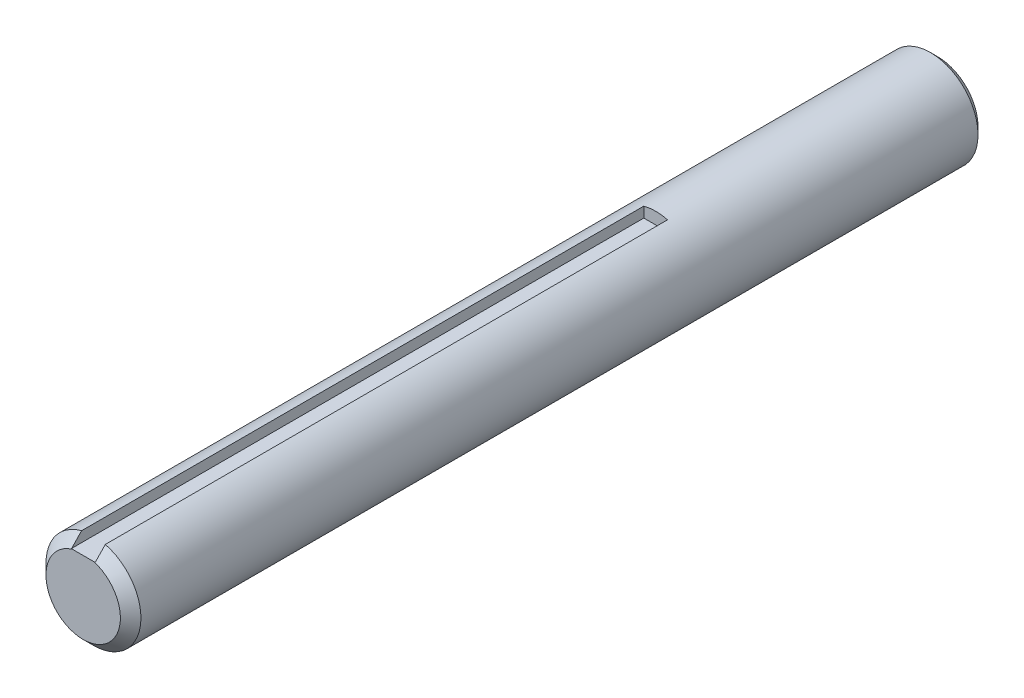
ISO-10303-21;
HEADER;
FILE_DESCRIPTION(('STEP AP214'),'2;1');
FILE_NAME('part.step','',(''),(''),'','','');
FILE_SCHEMA(('AUTOMOTIVE_DESIGN { 1 0 10303 214 1 1 1 1 }'));
ENDSEC;
DATA;
#1=APPLICATION_CONTEXT('core data for automotive mechanical design processes');
#2=APPLICATION_PROTOCOL_DEFINITION('international standard','automotive_design',2000,#1);
#3=PRODUCT_CONTEXT('',#1,'mechanical');
#4=PRODUCT('Part','Part','',(#3));
#5=PRODUCT_RELATED_PRODUCT_CATEGORY('part','',(#4));
#6=PRODUCT_DEFINITION_FORMATION('','',#4);
#7=PRODUCT_DEFINITION_CONTEXT('part definition',#1,'design');
#8=PRODUCT_DEFINITION('design','',#6,#7);
#9=PRODUCT_DEFINITION_SHAPE('','',#8);
#10=(LENGTH_UNIT() NAMED_UNIT(*) SI_UNIT(.MILLI.,.METRE.));
#11=(NAMED_UNIT(*) PLANE_ANGLE_UNIT() SI_UNIT($,.RADIAN.));
#12=(NAMED_UNIT(*) SI_UNIT($,.STERADIAN.) SOLID_ANGLE_UNIT());
#13=UNCERTAINTY_MEASURE_WITH_UNIT(LENGTH_MEASURE(1.E-05),#10,'distance_accuracy_value','');
#14=(GEOMETRIC_REPRESENTATION_CONTEXT(3) GLOBAL_UNCERTAINTY_ASSIGNED_CONTEXT((#13)) GLOBAL_UNIT_ASSIGNED_CONTEXT((#10,
#11,#12)) REPRESENTATION_CONTEXT('',''));
#15=CARTESIAN_POINT('',(0.,0.,0.));
#16=DIRECTION('',(0.,0.,1.));
#17=DIRECTION('',(1.,0.,0.));
#18=AXIS2_PLACEMENT_3D('',#15,#16,#17);
#19=CARTESIAN_POINT('',(0.,0.,76.2));
#20=DIRECTION('',(0.,0.,-1.));
#21=DIRECTION('',(-1.,0.,0.));
#22=AXIS2_PLACEMENT_3D('',#19,#20,#21);
#23=CYLINDRICAL_SURFACE('',#22,6.35);
#24=CARTESIAN_POINT('',(0.,0.,-75.2474999999999));
#25=DIRECTION('',(0.,0.,1.));
#26=DIRECTION('',(1.,0.,0.));
#27=AXIS2_PLACEMENT_3D('',#24,#25,#26);
#28=CIRCLE('',#27,6.35);
#29=CARTESIAN_POINT('',(6.35,0.,-75.2474999999999));
#30=VERTEX_POINT('',#29);
#31=EDGE_CURVE('E134',#30,#30,#28,.T.);
#32=ORIENTED_EDGE('',*,*,#31,.T.);
#33=EDGE_LOOP('',(#32));
#34=FACE_BOUND('',#33,.T.);
#35=DIRECTION('',(0.,0.,-1.));
#36=VECTOR('',#35,1.);
#37=CARTESIAN_POINT('',(1.5875,6.14836106210427,76.2));
#38=LINE('',#37,#36);
#39=CARTESIAN_POINT('',(1.5875,6.14836106210427,36.7264774740001));
#40=VERTEX_POINT('',#39);
#41=CARTESIAN_POINT('',(1.5875,6.14836106210427,-38.481));
#42=VERTEX_POINT('',#41);
#43=EDGE_CURVE('E106',#40,#42,#38,.T.);
#44=ORIENTED_EDGE('',*,*,#43,.F.);
#45=CARTESIAN_POINT('',(0.,0.,36.7264774740001));
#46=DIRECTION('',(0.,0.,1.));
#47=DIRECTION('',(1.,0.,0.));
#48=AXIS2_PLACEMENT_3D('',#45,#46,#47);
#49=CIRCLE('',#48,6.35);
#50=CARTESIAN_POINT('',(-1.5875,6.14836106210427,36.7264774740001));
#51=VERTEX_POINT('',#50);
#52=EDGE_CURVE('E58',#40,#51,#49,.F.);
#53=ORIENTED_EDGE('',*,*,#52,.T.);
#54=DIRECTION('',(0.,0.,-1.));
#55=VECTOR('',#54,1.);
#56=CARTESIAN_POINT('',(-1.5875,6.14836106210427,76.2));
#57=LINE('',#56,#55);
#58=CARTESIAN_POINT('',(-1.5875,6.14836106210427,-38.481));
#59=VERTEX_POINT('',#58);
#60=EDGE_CURVE('E131',#59,#51,#57,.F.);
#61=ORIENTED_EDGE('',*,*,#60,.F.);
#62=CARTESIAN_POINT('',(0.,0.,-38.481));
#63=DIRECTION('',(0.,0.,1.));
#64=DIRECTION('',(1.,0.,0.));
#65=AXIS2_PLACEMENT_3D('',#62,#63,#64);
#66=CIRCLE('',#65,6.35);
#67=EDGE_CURVE('E115',#42,#59,#66,.T.);
#68=ORIENTED_EDGE('',*,*,#67,.F.);
#69=EDGE_LOOP('',(#44,#53,#61,#68));
#70=FACE_BOUND('',#69,.T.);
#71=ADVANCED_FACE('F42',(#34,#70),#23,.T.);
#72=CARTESIAN_POINT('',(-1.5875,6.35,76.2));
#73=DIRECTION('',(1.,0.,0.));
#74=DIRECTION('',(0.,1.,0.));
#75=AXIS2_PLACEMENT_3D('',#72,#73,#74);
#76=PLANE('',#75);
#77=ORIENTED_EDGE('',*,*,#60,.T.);
#78=CARTESIAN_POINT('',(-1.5875,6.14836106210428,36.7264774740001));
#79=CARTESIAN_POINT('',(-1.5875,6.03336789474387,36.8378163218731));
#80=CARTESIAN_POINT('',(-1.5875,5.91827987354909,36.9490573642584));
#81=CARTESIAN_POINT('',(-1.5875,5.68787357366818,37.1712992426098));
#82=CARTESIAN_POINT('',(-1.5875,5.57255529644475,37.2823000800926));
#83=CARTESIAN_POINT('',(-1.5875,5.34164624267527,37.5040185916595));
#84=CARTESIAN_POINT('',(-1.5875,5.22605546557106,37.6147362651625));
#85=CARTESIAN_POINT('',(-1.5875,4.99454160696051,37.8358250479106));
#86=CARTESIAN_POINT('',(-1.5875,4.87861852334753,37.9461961549492));
#87=CARTESIAN_POINT('',(-1.5875,4.7625,38.0563616884828));
#88=B_SPLINE_CURVE_WITH_KNOTS('',3,(#78,#79,#80,#81,#82,#83,#84,#85,#86,#87),.UNSPECIFIED.,.F.,
.F.,(4,2,2,2,4),(0.,0.480185385737946,0.960367730766998,1.44055106023391,1.92073744058339),.UNSPECIFIED.);
#89=CARTESIAN_POINT('',(-1.5875,4.7625,38.0563616884828));
#90=VERTEX_POINT('',#89);
#91=EDGE_CURVE('E12',#51,#90,#88,.T.);
#92=ORIENTED_EDGE('',*,*,#91,.T.);
#93=DIRECTION('',(0.,0.,-1.));
#94=VECTOR('',#93,1.);
#95=CARTESIAN_POINT('',(-1.5875,4.7625,76.2));
#96=LINE('',#95,#94);
#97=CARTESIAN_POINT('',(-1.5875,4.7625,-38.481));
#98=VERTEX_POINT('',#97);
#99=EDGE_CURVE('E97',#90,#98,#96,.T.);
#100=ORIENTED_EDGE('',*,*,#99,.T.);
#101=DIRECTION('',(0.,-1.,0.));
#102=VECTOR('',#101,1.);
#103=CARTESIAN_POINT('',(-1.5875,6.35,-38.481));
#104=LINE('',#103,#102);
#105=EDGE_CURVE('E100',#59,#98,#104,.T.);
#106=ORIENTED_EDGE('',*,*,#105,.F.);
#107=EDGE_LOOP('',(#77,#92,#100,#106));
#108=FACE_BOUND('',#107,.T.);
#109=ADVANCED_FACE('F99',(#108),#76,.T.);
#110=CARTESIAN_POINT('',(1.5875,6.35,76.2));
#111=DIRECTION('',(-1.,0.,0.));
#112=DIRECTION('',(0.,-1.,0.));
#113=AXIS2_PLACEMENT_3D('',#110,#111,#112);
#114=PLANE('',#113);
#115=DIRECTION('',(0.,0.,-1.));
#116=VECTOR('',#115,1.);
#117=CARTESIAN_POINT('',(1.5875,4.7625,76.2));
#118=LINE('',#117,#116);
#119=CARTESIAN_POINT('',(1.5875,4.7625,38.0563616884828));
#120=VERTEX_POINT('',#119);
#121=CARTESIAN_POINT('',(1.5875,4.7625,-38.481));
#122=VERTEX_POINT('',#121);
#123=EDGE_CURVE('E107',#120,#122,#118,.T.);
#124=ORIENTED_EDGE('',*,*,#123,.F.);
#125=CARTESIAN_POINT('',(1.5875,4.7625,38.0563616884828));
#126=CARTESIAN_POINT('',(1.5875,4.87861852334753,37.9461961549492));
#127=CARTESIAN_POINT('',(1.5875,4.99454160696051,37.8358250479106));
#128=CARTESIAN_POINT('',(1.5875,5.22605546557106,37.6147362651625));
#129=CARTESIAN_POINT('',(1.5875,5.34164624267527,37.5040185916595));
#130=CARTESIAN_POINT('',(1.5875,5.57255529644475,37.2823000800926));
#131=CARTESIAN_POINT('',(1.5875,5.68787357366818,37.1712992426098));
#132=CARTESIAN_POINT('',(1.5875,5.91827987354909,36.9490573642584));
#133=CARTESIAN_POINT('',(1.5875,6.03336789474387,36.8378163218731));
#134=CARTESIAN_POINT('',(1.5875,6.14836106210428,36.7264774740001));
#135=B_SPLINE_CURVE_WITH_KNOTS('',3,(#125,#126,#127,#128,#129,#130,#131,#132,#133,#134),
.UNSPECIFIED.,.F.,.F.,(4,2,2,2,4),(0.,0.48018638034948,0.960369709816388,1.44055205484544,
1.92073744058339),.UNSPECIFIED.);
#136=EDGE_CURVE('E72',#120,#40,#135,.T.);
#137=ORIENTED_EDGE('',*,*,#136,.T.);
#138=ORIENTED_EDGE('',*,*,#43,.T.);
#139=DIRECTION('',(0.,1.,0.));
#140=VECTOR('',#139,1.);
#141=CARTESIAN_POINT('',(1.5875,6.35,-38.481));
#142=LINE('',#141,#140);
#143=EDGE_CURVE('E122',#122,#42,#142,.T.);
#144=ORIENTED_EDGE('',*,*,#143,.F.);
#145=EDGE_LOOP('',(#124,#137,#138,#144));
#146=FACE_BOUND('',#145,.T.);
#147=ADVANCED_FACE('F169',(#146),#114,.T.);
#148=CARTESIAN_POINT('',(-1.5875,4.7625,76.2));
#149=DIRECTION('',(0.,1.,0.));
#150=DIRECTION('',(0.,0.,1.));
#151=AXIS2_PLACEMENT_3D('',#148,#149,#150);
#152=PLANE('',#151);
#153=DIRECTION('',(1.,0.,0.));
#154=VECTOR('',#153,1.);
#155=CARTESIAN_POINT('',(-1.5875,4.7625,38.1));
#156=LINE('',#155,#154);
#157=CARTESIAN_POINT('',(-1.44357950914735,4.7625,38.1));
#158=VERTEX_POINT('',#157);
#159=CARTESIAN_POINT('',(1.44357950914735,4.7625,38.1));
#160=VERTEX_POINT('',#159);
#161=EDGE_CURVE('E144',#158,#160,#156,.T.);
#162=ORIENTED_EDGE('',*,*,#161,.T.);
#163=CARTESIAN_POINT('',(1.44357950914735,4.7625,38.1));
#164=CARTESIAN_POINT('',(1.46765334194813,4.7625,38.0930141413426));
#165=CARTESIAN_POINT('',(1.49168363445585,4.7625,38.0858846854626));
#166=CARTESIAN_POINT('',(1.53965713137949,4.7625,38.0713385815337));
#167=CARTESIAN_POINT('',(1.56360033582265,4.7625,38.0639219335745));
#168=CARTESIAN_POINT('',(1.5875,4.7625,38.0563616884828));
#169=B_SPLINE_CURVE_WITH_KNOTS('',3,(#163,#164,#165,#166,#167,#168),.UNSPECIFIED.,.F.,.F.,(4,2,
4),(0.,0.0751967877795014,0.150393552029123),.UNSPECIFIED.);
#170=EDGE_CURVE('E159',#160,#120,#169,.T.);
#171=ORIENTED_EDGE('',*,*,#170,.T.);
#172=ORIENTED_EDGE('',*,*,#123,.T.);
#173=DIRECTION('',(1.,0.,0.));
#174=VECTOR('',#173,1.);
#175=CARTESIAN_POINT('',(-1.5875,4.7625,-38.481));
#176=LINE('',#175,#174);
#177=EDGE_CURVE('E113',#98,#122,#176,.T.);
#178=ORIENTED_EDGE('',*,*,#177,.F.);
#179=ORIENTED_EDGE('',*,*,#99,.F.);
#180=CARTESIAN_POINT('',(-1.5875,4.7625,38.0563616884828));
#181=CARTESIAN_POINT('',(-1.56360033582265,4.7625,38.0639219335745));
#182=CARTESIAN_POINT('',(-1.53965713137949,4.7625,38.0713385815337));
#183=CARTESIAN_POINT('',(-1.49168363445585,4.7625,38.0858846854626));
#184=CARTESIAN_POINT('',(-1.46765334194813,4.7625,38.0930141413426));
#185=CARTESIAN_POINT('',(-1.44357950914735,4.7625,38.1));
#186=B_SPLINE_CURVE_WITH_KNOTS('',3,(#180,#181,#182,#183,#184,#185),.UNSPECIFIED.,.F.,.F.,(4,2,
4),(0.,0.0751967642496202,0.150393552029121),.UNSPECIFIED.);
#187=EDGE_CURVE('E151',#90,#158,#186,.T.);
#188=ORIENTED_EDGE('',*,*,#187,.T.);
#189=EDGE_LOOP('',(#162,#171,#172,#178,#179,#188));
#190=FACE_BOUND('',#189,.T.);
#191=ADVANCED_FACE('F119',(#190),#152,.T.);
#192=CARTESIAN_POINT('',(0.,0.,-76.2));
#193=DIRECTION('',(0.,0.,1.));
#194=DIRECTION('',(1.,0.,0.));
#195=AXIS2_PLACEMENT_3D('',#192,#193,#194);
#196=PLANE('',#195);
#197=CARTESIAN_POINT('',(0.,0.,-76.2));
#198=DIRECTION('',(0.,0.,1.));
#199=DIRECTION('',(1.,0.,0.));
#200=AXIS2_PLACEMENT_3D('',#197,#198,#199);
#201=CIRCLE('',#200,5.39749999999989);
#202=CARTESIAN_POINT('',(5.39749999999989,0.,-76.2));
#203=VERTEX_POINT('',#202);
#204=EDGE_CURVE('E138',#203,#203,#201,.F.);
#205=ORIENTED_EDGE('',*,*,#204,.T.);
#206=EDGE_LOOP('',(#205));
#207=FACE_BOUND('',#206,.T.);
#208=ADVANCED_FACE('F168',(#207),#196,.F.);
#209=CARTESIAN_POINT('',(0.,0.,-75.2474999999999));
#210=DIRECTION('',(0.,0.,1.));
#211=DIRECTION('',(1.,0.,0.));
#212=AXIS2_PLACEMENT_3D('',#209,#210,#211);
#213=CONICAL_SURFACE('',#212,6.35,0.785398163397451);
#214=ORIENTED_EDGE('',*,*,#204,.F.);
#215=EDGE_LOOP('',(#214));
#216=FACE_BOUND('',#215,.T.);
#217=ORIENTED_EDGE('',*,*,#31,.F.);
#218=EDGE_LOOP('',(#217));
#219=FACE_BOUND('',#218,.T.);
#220=ADVANCED_FACE('F178',(#216,#219),#213,.T.);
#221=CARTESIAN_POINT('',(-1.5875,4.7625,-38.481));
#222=DIRECTION('',(0.,0.,1.));
#223=DIRECTION('',(1.,0.,0.));
#224=AXIS2_PLACEMENT_3D('',#221,#222,#223);
#225=PLANE('',#224);
#226=ORIENTED_EDGE('',*,*,#143,.T.);
#227=ORIENTED_EDGE('',*,*,#67,.T.);
#228=ORIENTED_EDGE('',*,*,#105,.T.);
#229=ORIENTED_EDGE('',*,*,#177,.T.);
#230=EDGE_LOOP('',(#226,#227,#228,#229));
#231=FACE_BOUND('',#230,.T.);
#232=ADVANCED_FACE('F112',(#231),#225,.T.);
#233=CARTESIAN_POINT('',(0.,0.,38.1));
#234=DIRECTION('',(0.,0.,1.));
#235=DIRECTION('',(1.,0.,0.));
#236=AXIS2_PLACEMENT_3D('',#233,#234,#235);
#237=PLANE('',#236);
#238=ORIENTED_EDGE('',*,*,#161,.F.);
#239=CARTESIAN_POINT('',(0.,0.,38.1));
#240=DIRECTION('',(0.,0.,1.));
#241=DIRECTION('',(1.,0.,0.));
#242=AXIS2_PLACEMENT_3D('',#239,#240,#241);
#243=CIRCLE('',#242,4.97647747400007);
#244=EDGE_CURVE('E147',#158,#160,#243,.T.);
#245=ORIENTED_EDGE('',*,*,#244,.T.);
#246=EDGE_LOOP('',(#238,#245));
#247=FACE_BOUND('',#246,.T.);
#248=ADVANCED_FACE('F187',(#247),#237,.T.);
#249=CARTESIAN_POINT('',(0.,0.,38.1));
#250=DIRECTION('',(0.,0.,-1.));
#251=DIRECTION('',(-1.,0.,0.));
#252=AXIS2_PLACEMENT_3D('',#249,#250,#251);
#253=CONICAL_SURFACE('',#252,4.97647747400007,0.785398163397443);
#254=ORIENTED_EDGE('',*,*,#91,.F.);
#255=ORIENTED_EDGE('',*,*,#52,.F.);
#256=ORIENTED_EDGE('',*,*,#136,.F.);
#257=ORIENTED_EDGE('',*,*,#170,.F.);
#258=ORIENTED_EDGE('',*,*,#244,.F.);
#259=ORIENTED_EDGE('',*,*,#187,.F.);
#260=EDGE_LOOP('',(#254,#255,#256,#257,#258,#259));
#261=FACE_BOUND('',#260,.T.);
#262=ADVANCED_FACE('F45',(#261),#253,.T.);
#263=CLOSED_SHELL('',(#71,#109,#147,#191,#208,#220,#232,#248,#262));
#264=MANIFOLD_SOLID_BREP('B2',#263);
#265=ADVANCED_BREP_SHAPE_REPRESENTATION('',(#18,#264),#14);
#266=SHAPE_DEFINITION_REPRESENTATION(#9,#265);
ENDSEC;
END-ISO-10303-21;
